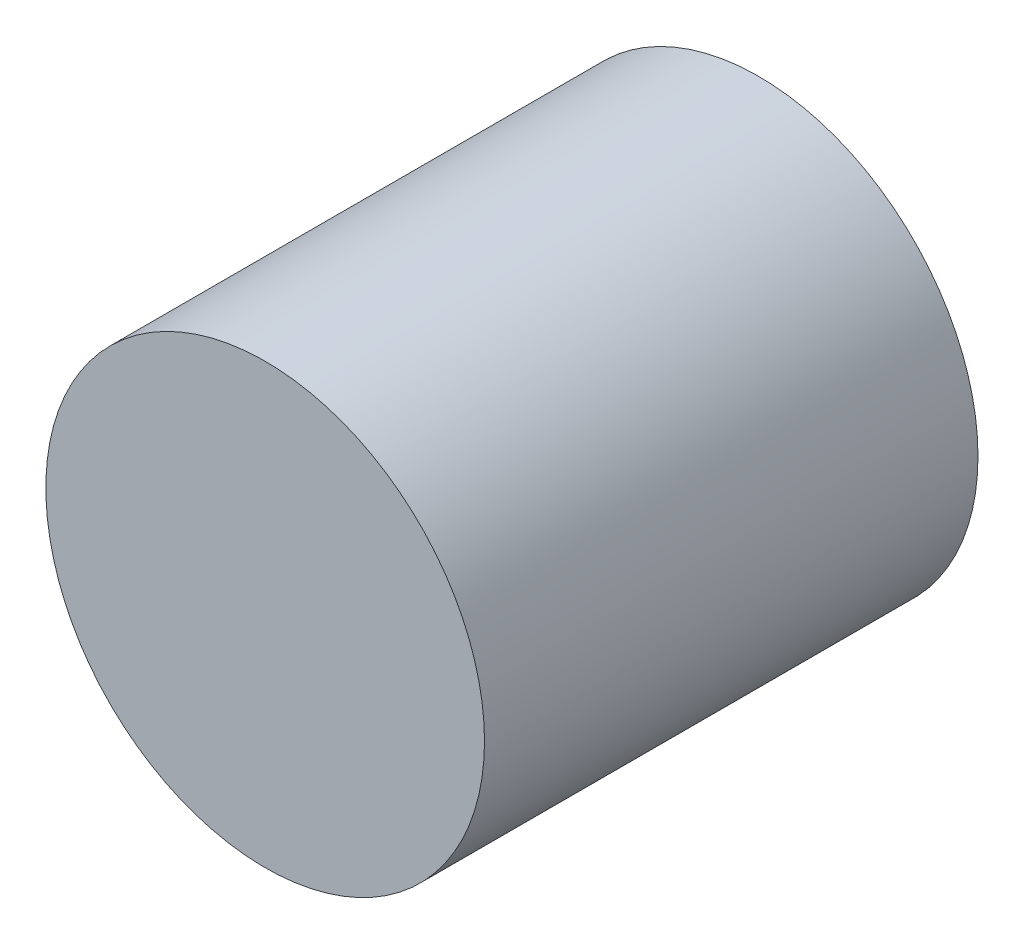
ISO-10303-21;
HEADER;
FILE_DESCRIPTION(('STEP AP214'),'2;1');
FILE_NAME('part.step','',(''),(''),'','','');
FILE_SCHEMA(('AUTOMOTIVE_DESIGN { 1 0 10303 214 1 1 1 1 }'));
ENDSEC;
DATA;
#1=APPLICATION_CONTEXT('core data for automotive mechanical design processes');
#2=APPLICATION_PROTOCOL_DEFINITION('international standard','automotive_design',2000,#1);
#3=PRODUCT_CONTEXT('',#1,'mechanical');
#4=PRODUCT('Part','Part','',(#3));
#5=PRODUCT_RELATED_PRODUCT_CATEGORY('part','',(#4));
#6=PRODUCT_DEFINITION_FORMATION('','',#4);
#7=PRODUCT_DEFINITION_CONTEXT('part definition',#1,'design');
#8=PRODUCT_DEFINITION('design','',#6,#7);
#9=PRODUCT_DEFINITION_SHAPE('','',#8);
#10=(LENGTH_UNIT() NAMED_UNIT(*) SI_UNIT(.MILLI.,.METRE.));
#11=(NAMED_UNIT(*) PLANE_ANGLE_UNIT() SI_UNIT($,.RADIAN.));
#12=(NAMED_UNIT(*) SI_UNIT($,.STERADIAN.) SOLID_ANGLE_UNIT());
#13=UNCERTAINTY_MEASURE_WITH_UNIT(LENGTH_MEASURE(1.E-05),#10,'distance_accuracy_value','');
#14=(GEOMETRIC_REPRESENTATION_CONTEXT(3) GLOBAL_UNCERTAINTY_ASSIGNED_CONTEXT((#13)) GLOBAL_UNIT_ASSIGNED_CONTEXT((#10,
#11,#12)) REPRESENTATION_CONTEXT('',''));
#15=CARTESIAN_POINT('',(0.,0.,0.));
#16=DIRECTION('',(0.,0.,1.));
#17=DIRECTION('',(1.,0.,0.));
#18=AXIS2_PLACEMENT_3D('',#15,#16,#17);
#19=CARTESIAN_POINT('',(0.,0.,4.5));
#20=DIRECTION('',(0.,0.,-1.));
#21=DIRECTION('',(-1.,0.,0.));
#22=AXIS2_PLACEMENT_3D('',#19,#20,#21);
#23=CYLINDRICAL_SURFACE('',#22,4.);
#24=CARTESIAN_POINT('',(0.,0.,4.5));
#25=DIRECTION('',(0.,0.,1.));
#26=DIRECTION('',(1.,0.,0.));
#27=AXIS2_PLACEMENT_3D('',#24,#25,#26);
#28=CIRCLE('',#27,4.);
#29=CARTESIAN_POINT('',(4.,0.,4.5));
#30=VERTEX_POINT('',#29);
#31=EDGE_CURVE('E10',#30,#30,#28,.T.);
#32=ORIENTED_EDGE('',*,*,#31,.F.);
#33=EDGE_LOOP('',(#32));
#34=FACE_BOUND('',#33,.T.);
#35=CARTESIAN_POINT('',(0.,0.,-4.5));
#36=DIRECTION('',(0.,0.,1.));
#37=DIRECTION('',(1.,0.,0.));
#38=AXIS2_PLACEMENT_3D('',#35,#36,#37);
#39=CIRCLE('',#38,4.);
#40=CARTESIAN_POINT('',(4.,0.,-4.5));
#41=VERTEX_POINT('',#40);
#42=EDGE_CURVE('E36',#41,#41,#39,.T.);
#43=ORIENTED_EDGE('',*,*,#42,.T.);
#44=EDGE_LOOP('',(#43));
#45=FACE_BOUND('',#44,.T.);
#46=ADVANCED_FACE('F33',(#34,#45),#23,.T.);
#47=CARTESIAN_POINT('',(0.,0.,4.5));
#48=DIRECTION('',(0.,0.,1.));
#49=DIRECTION('',(1.,0.,0.));
#50=AXIS2_PLACEMENT_3D('',#47,#48,#49);
#51=PLANE('',#50);
#52=ORIENTED_EDGE('',*,*,#31,.T.);
#53=EDGE_LOOP('',(#52));
#54=FACE_BOUND('',#53,.T.);
#55=ADVANCED_FACE('F48',(#54),#51,.T.);
#56=CARTESIAN_POINT('',(0.,0.,-4.5));
#57=DIRECTION('',(0.,0.,1.));
#58=DIRECTION('',(1.,0.,0.));
#59=AXIS2_PLACEMENT_3D('',#56,#57,#58);
#60=PLANE('',#59);
#61=ORIENTED_EDGE('',*,*,#42,.F.);
#62=EDGE_LOOP('',(#61));
#63=FACE_BOUND('',#62,.T.);
#64=ADVANCED_FACE('F46',(#63),#60,.F.);
#65=CLOSED_SHELL('',(#46,#55,#64));
#66=MANIFOLD_SOLID_BREP('B2',#65);
#67=ADVANCED_BREP_SHAPE_REPRESENTATION('',(#18,#66),#14);
#68=SHAPE_DEFINITION_REPRESENTATION(#9,#67);
ENDSEC;
END-ISO-10303-21;
